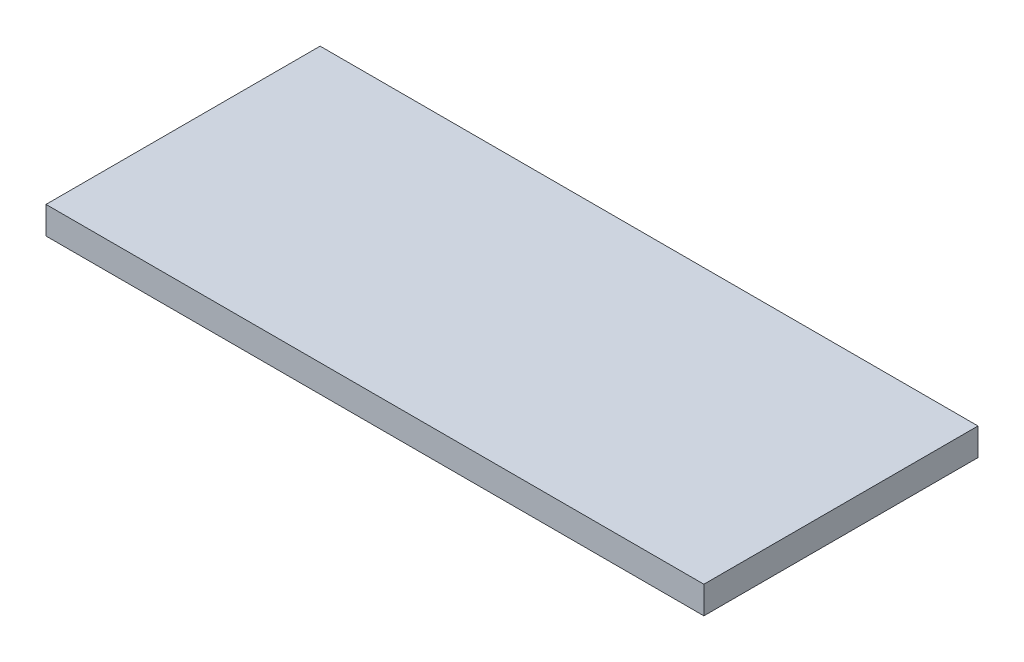
ISO-10303-21;
HEADER;
FILE_DESCRIPTION(('STEP AP214'),'2;1');
FILE_NAME('part.step','',(''),(''),'','','');
FILE_SCHEMA(('AUTOMOTIVE_DESIGN { 1 0 10303 214 1 1 1 1 }'));
ENDSEC;
DATA;
#1=APPLICATION_CONTEXT('core data for automotive mechanical design processes');
#2=APPLICATION_PROTOCOL_DEFINITION('international standard','automotive_design',2000,#1);
#3=PRODUCT_CONTEXT('',#1,'mechanical');
#4=PRODUCT('Part','Part','',(#3));
#5=PRODUCT_RELATED_PRODUCT_CATEGORY('part','',(#4));
#6=PRODUCT_DEFINITION_FORMATION('','',#4);
#7=PRODUCT_DEFINITION_CONTEXT('part definition',#1,'design');
#8=PRODUCT_DEFINITION('design','',#6,#7);
#9=PRODUCT_DEFINITION_SHAPE('','',#8);
#10=(LENGTH_UNIT() NAMED_UNIT(*) SI_UNIT(.MILLI.,.METRE.));
#11=(NAMED_UNIT(*) PLANE_ANGLE_UNIT() SI_UNIT($,.RADIAN.));
#12=(NAMED_UNIT(*) SI_UNIT($,.STERADIAN.) SOLID_ANGLE_UNIT());
#13=UNCERTAINTY_MEASURE_WITH_UNIT(LENGTH_MEASURE(1.E-05),#10,'distance_accuracy_value','');
#14=(GEOMETRIC_REPRESENTATION_CONTEXT(3) GLOBAL_UNCERTAINTY_ASSIGNED_CONTEXT((#13)) GLOBAL_UNIT_ASSIGNED_CONTEXT((#10,
#11,#12)) REPRESENTATION_CONTEXT('',''));
#15=CARTESIAN_POINT('',(0.,0.,0.));
#16=DIRECTION('',(0.,0.,1.));
#17=DIRECTION('',(1.,0.,0.));
#18=AXIS2_PLACEMENT_3D('',#15,#16,#17);
#19=CARTESIAN_POINT('',(-66.2085308056872,5.,-10.781990521327));
#20=DIRECTION('',(1.,0.,0.));
#21=DIRECTION('',(0.,0.,-1.));
#22=AXIS2_PLACEMENT_3D('',#19,#20,#21);
#23=PLANE('',#22);
#24=DIRECTION('',(0.,0.,1.));
#25=VECTOR('',#24,1.);
#26=CARTESIAN_POINT('',(-66.2085308056872,0.,-10.781990521327));
#27=LINE('',#26,#25);
#28=CARTESIAN_POINT('',(-66.2085308056872,0.,-10.781990521327));
#29=VERTEX_POINT('',#28);
#30=CARTESIAN_POINT('',(-66.2085308056872,0.,39.218009478673));
#31=VERTEX_POINT('',#30);
#32=EDGE_CURVE('E96',#29,#31,#27,.T.);
#33=ORIENTED_EDGE('',*,*,#32,.T.);
#34=DIRECTION('',(0.,-1.,0.));
#35=VECTOR('',#34,1.);
#36=CARTESIAN_POINT('',(-66.2085308056872,5.,39.218009478673));
#37=LINE('',#36,#35);
#38=CARTESIAN_POINT('',(-66.2085308056872,5.,39.218009478673));
#39=VERTEX_POINT('',#38);
#40=EDGE_CURVE('E11',#39,#31,#37,.T.);
#41=ORIENTED_EDGE('',*,*,#40,.F.);
#42=DIRECTION('',(0.,0.,1.));
#43=VECTOR('',#42,1.);
#44=CARTESIAN_POINT('',(-66.2085308056872,5.,-10.781990521327));
#45=LINE('',#44,#43);
#46=CARTESIAN_POINT('',(-66.2085308056872,5.,-10.781990521327));
#47=VERTEX_POINT('',#46);
#48=EDGE_CURVE('E84',#47,#39,#45,.T.);
#49=ORIENTED_EDGE('',*,*,#48,.F.);
#50=DIRECTION('',(0.,-1.,0.));
#51=VECTOR('',#50,1.);
#52=CARTESIAN_POINT('',(-66.2085308056872,5.,-10.781990521327));
#53=LINE('',#52,#51);
#54=EDGE_CURVE('E92',#47,#29,#53,.T.);
#55=ORIENTED_EDGE('',*,*,#54,.T.);
#56=EDGE_LOOP('',(#33,#41,#49,#55));
#57=FACE_BOUND('',#56,.T.);
#58=ADVANCED_FACE('F33',(#57),#23,.F.);
#59=CARTESIAN_POINT('',(-66.2085308056872,5.,39.218009478673));
#60=DIRECTION('',(0.,0.,-1.));
#61=DIRECTION('',(-1.,0.,0.));
#62=AXIS2_PLACEMENT_3D('',#59,#60,#61);
#63=PLANE('',#62);
#64=DIRECTION('',(1.,0.,0.));
#65=VECTOR('',#64,1.);
#66=CARTESIAN_POINT('',(-66.2085308056872,0.,39.218009478673));
#67=LINE('',#66,#65);
#68=CARTESIAN_POINT('',(53.7914691943128,0.,39.218009478673));
#69=VERTEX_POINT('',#68);
#70=EDGE_CURVE('E88',#31,#69,#67,.T.);
#71=ORIENTED_EDGE('',*,*,#70,.T.);
#72=DIRECTION('',(0.,-1.,0.));
#73=VECTOR('',#72,1.);
#74=CARTESIAN_POINT('',(53.7914691943128,5.,39.218009478673));
#75=LINE('',#74,#73);
#76=CARTESIAN_POINT('',(53.7914691943128,5.,39.218009478673));
#77=VERTEX_POINT('',#76);
#78=EDGE_CURVE('E41',#77,#69,#75,.T.);
#79=ORIENTED_EDGE('',*,*,#78,.F.);
#80=DIRECTION('',(1.,0.,0.));
#81=VECTOR('',#80,1.);
#82=CARTESIAN_POINT('',(-66.2085308056872,5.,39.218009478673));
#83=LINE('',#82,#81);
#84=EDGE_CURVE('E79',#39,#77,#83,.T.);
#85=ORIENTED_EDGE('',*,*,#84,.F.);
#86=ORIENTED_EDGE('',*,*,#40,.T.);
#87=EDGE_LOOP('',(#71,#79,#85,#86));
#88=FACE_BOUND('',#87,.T.);
#89=ADVANCED_FACE('F87',(#88),#63,.F.);
#90=CARTESIAN_POINT('',(53.7914691943128,5.,-10.781990521327));
#91=DIRECTION('',(-1.,0.,0.));
#92=DIRECTION('',(0.,0.,1.));
#93=AXIS2_PLACEMENT_3D('',#90,#91,#92);
#94=PLANE('',#93);
#95=DIRECTION('',(0.,0.,-1.));
#96=VECTOR('',#95,1.);
#97=CARTESIAN_POINT('',(53.7914691943128,0.,-10.781990521327));
#98=LINE('',#97,#96);
#99=CARTESIAN_POINT('',(53.7914691943128,0.,-10.781990521327));
#100=VERTEX_POINT('',#99);
#101=EDGE_CURVE('E66',#69,#100,#98,.T.);
#102=ORIENTED_EDGE('',*,*,#101,.T.);
#103=DIRECTION('',(0.,-1.,0.));
#104=VECTOR('',#103,1.);
#105=CARTESIAN_POINT('',(53.7914691943128,5.,-10.781990521327));
#106=LINE('',#105,#104);
#107=CARTESIAN_POINT('',(53.7914691943128,5.,-10.781990521327));
#108=VERTEX_POINT('',#107);
#109=EDGE_CURVE('E89',#108,#100,#106,.T.);
#110=ORIENTED_EDGE('',*,*,#109,.F.);
#111=DIRECTION('',(0.,0.,-1.));
#112=VECTOR('',#111,1.);
#113=CARTESIAN_POINT('',(53.7914691943128,5.,-10.781990521327));
#114=LINE('',#113,#112);
#115=EDGE_CURVE('E82',#77,#108,#114,.T.);
#116=ORIENTED_EDGE('',*,*,#115,.F.);
#117=ORIENTED_EDGE('',*,*,#78,.T.);
#118=EDGE_LOOP('',(#102,#110,#116,#117));
#119=FACE_BOUND('',#118,.T.);
#120=ADVANCED_FACE('F90',(#119),#94,.F.);
#121=CARTESIAN_POINT('',(-66.2085308056872,5.,-10.781990521327));
#122=DIRECTION('',(0.,0.,1.));
#123=DIRECTION('',(1.,0.,0.));
#124=AXIS2_PLACEMENT_3D('',#121,#122,#123);
#125=PLANE('',#124);
#126=DIRECTION('',(-1.,0.,0.));
#127=VECTOR('',#126,1.);
#128=CARTESIAN_POINT('',(-66.2085308056872,0.,-10.781990521327));
#129=LINE('',#128,#127);
#130=EDGE_CURVE('E72',#100,#29,#129,.T.);
#131=ORIENTED_EDGE('',*,*,#130,.T.);
#132=ORIENTED_EDGE('',*,*,#54,.F.);
#133=DIRECTION('',(-1.,0.,0.));
#134=VECTOR('',#133,1.);
#135=CARTESIAN_POINT('',(-66.2085308056872,5.,-10.781990521327));
#136=LINE('',#135,#134);
#137=EDGE_CURVE('E49',#108,#47,#136,.T.);
#138=ORIENTED_EDGE('',*,*,#137,.F.);
#139=ORIENTED_EDGE('',*,*,#109,.T.);
#140=EDGE_LOOP('',(#131,#132,#138,#139));
#141=FACE_BOUND('',#140,.T.);
#142=ADVANCED_FACE('F103',(#141),#125,.F.);
#143=CARTESIAN_POINT('',(0.,5.,0.));
#144=DIRECTION('',(0.,1.,0.));
#145=DIRECTION('',(0.,0.,1.));
#146=AXIS2_PLACEMENT_3D('',#143,#144,#145);
#147=PLANE('',#146);
#148=ORIENTED_EDGE('',*,*,#48,.T.);
#149=ORIENTED_EDGE('',*,*,#84,.T.);
#150=ORIENTED_EDGE('',*,*,#115,.T.);
#151=ORIENTED_EDGE('',*,*,#137,.T.);
#152=EDGE_LOOP('',(#148,#149,#150,#151));
#153=FACE_BOUND('',#152,.T.);
#154=ADVANCED_FACE('F80',(#153),#147,.T.);
#155=CARTESIAN_POINT('',(0.,0.,0.));
#156=DIRECTION('',(0.,1.,0.));
#157=DIRECTION('',(0.,0.,1.));
#158=AXIS2_PLACEMENT_3D('',#155,#156,#157);
#159=PLANE('',#158);
#160=ORIENTED_EDGE('',*,*,#32,.F.);
#161=ORIENTED_EDGE('',*,*,#130,.F.);
#162=ORIENTED_EDGE('',*,*,#101,.F.);
#163=ORIENTED_EDGE('',*,*,#70,.F.);
#164=EDGE_LOOP('',(#160,#161,#162,#163));
#165=FACE_BOUND('',#164,.T.);
#166=ADVANCED_FACE('F106',(#165),#159,.F.);
#167=CLOSED_SHELL('',(#58,#89,#120,#142,#154,#166));
#168=MANIFOLD_SOLID_BREP('B2',#167);
#169=ADVANCED_BREP_SHAPE_REPRESENTATION('',(#18,#168),#14);
#170=SHAPE_DEFINITION_REPRESENTATION(#9,#169);
ENDSEC;
END-ISO-10303-21;
